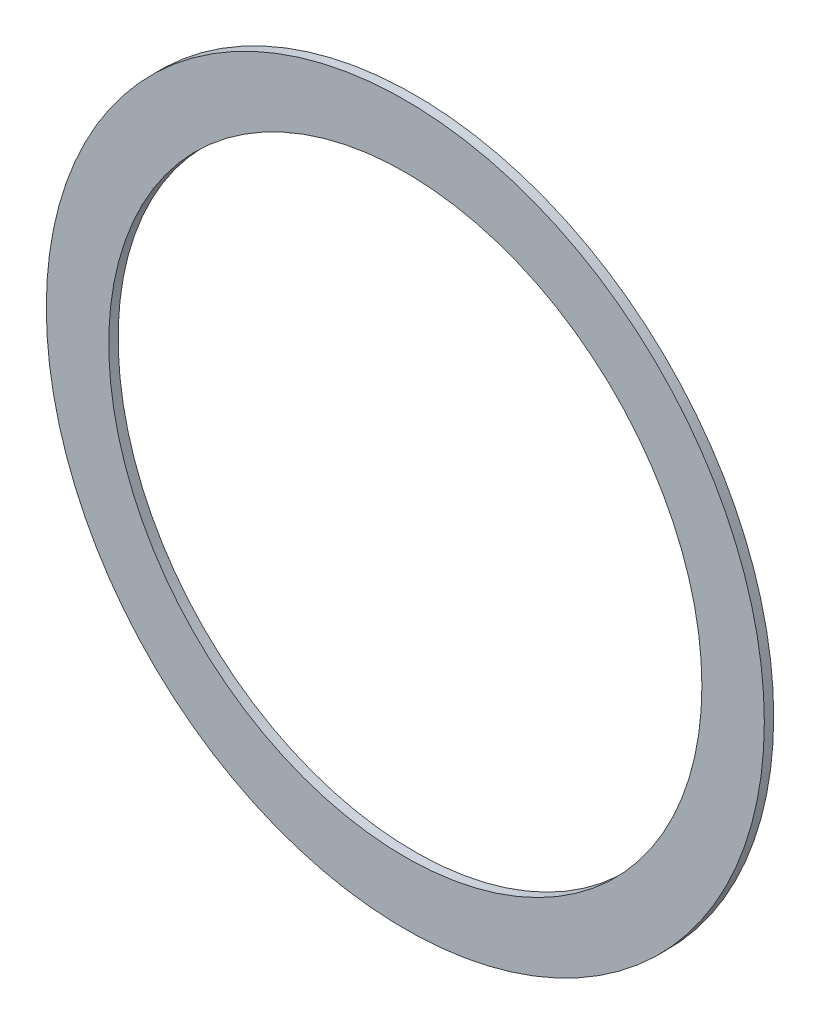
ISO-10303-21;
HEADER;
FILE_DESCRIPTION(('STEP AP214'),'2;1');
FILE_NAME('part.step','',(''),(''),'','','');
FILE_SCHEMA(('AUTOMOTIVE_DESIGN { 1 0 10303 214 1 1 1 1 }'));
ENDSEC;
DATA;
#1=APPLICATION_CONTEXT('core data for automotive mechanical design processes');
#2=APPLICATION_PROTOCOL_DEFINITION('international standard','automotive_design',2000,#1);
#3=PRODUCT_CONTEXT('',#1,'mechanical');
#4=PRODUCT('Part','Part','',(#3));
#5=PRODUCT_RELATED_PRODUCT_CATEGORY('part','',(#4));
#6=PRODUCT_DEFINITION_FORMATION('','',#4);
#7=PRODUCT_DEFINITION_CONTEXT('part definition',#1,'design');
#8=PRODUCT_DEFINITION('design','',#6,#7);
#9=PRODUCT_DEFINITION_SHAPE('','',#8);
#10=(LENGTH_UNIT() NAMED_UNIT(*) SI_UNIT(.MILLI.,.METRE.));
#11=(NAMED_UNIT(*) PLANE_ANGLE_UNIT() SI_UNIT($,.RADIAN.));
#12=(NAMED_UNIT(*) SI_UNIT($,.STERADIAN.) SOLID_ANGLE_UNIT());
#13=UNCERTAINTY_MEASURE_WITH_UNIT(LENGTH_MEASURE(1.E-05),#10,'distance_accuracy_value','');
#14=(GEOMETRIC_REPRESENTATION_CONTEXT(3) GLOBAL_UNCERTAINTY_ASSIGNED_CONTEXT((#13)) GLOBAL_UNIT_ASSIGNED_CONTEXT((#10,
#11,#12)) REPRESENTATION_CONTEXT('',''));
#15=CARTESIAN_POINT('',(0.,0.,0.));
#16=DIRECTION('',(0.,0.,1.));
#17=DIRECTION('',(1.,0.,0.));
#18=AXIS2_PLACEMENT_3D('',#15,#16,#17);
#19=CARTESIAN_POINT('',(0.,0.,3.));
#20=DIRECTION('',(0.,0.,1.));
#21=DIRECTION('',(1.,0.,0.));
#22=AXIS2_PLACEMENT_3D('',#19,#20,#21);
#23=PLANE('',#22);
#24=CARTESIAN_POINT('',(0.,0.,3.));
#25=DIRECTION('',(0.,0.,1.));
#26=DIRECTION('',(1.,0.,0.));
#27=AXIS2_PLACEMENT_3D('',#24,#25,#26);
#28=CIRCLE('',#27,115.);
#29=CARTESIAN_POINT('',(115.,0.,3.));
#30=VERTEX_POINT('',#29);
#31=EDGE_CURVE('E10',#30,#30,#28,.T.);
#32=ORIENTED_EDGE('',*,*,#31,.T.);
#33=EDGE_LOOP('',(#32));
#34=FACE_BOUND('',#33,.T.);
#35=CARTESIAN_POINT('',(0.,0.,3.));
#36=DIRECTION('',(0.,0.,1.));
#37=DIRECTION('',(1.,0.,0.));
#38=AXIS2_PLACEMENT_3D('',#35,#36,#37);
#39=CIRCLE('',#38,95.);
#40=CARTESIAN_POINT('',(95.,0.,3.));
#41=VERTEX_POINT('',#40);
#42=EDGE_CURVE('E42',#41,#41,#39,.T.);
#43=ORIENTED_EDGE('',*,*,#42,.F.);
#44=EDGE_LOOP('',(#43));
#45=FACE_BOUND('',#44,.T.);
#46=ADVANCED_FACE('F31',(#34,#45),#23,.T.);
#47=CARTESIAN_POINT('',(0.,0.,0.));
#48=DIRECTION('',(0.,0.,1.));
#49=DIRECTION('',(1.,0.,0.));
#50=AXIS2_PLACEMENT_3D('',#47,#48,#49);
#51=PLANE('',#50);
#52=CARTESIAN_POINT('',(0.,0.,0.));
#53=DIRECTION('',(0.,0.,1.));
#54=DIRECTION('',(1.,0.,0.));
#55=AXIS2_PLACEMENT_3D('',#52,#53,#54);
#56=CIRCLE('',#55,115.);
#57=CARTESIAN_POINT('',(115.,0.,0.));
#58=VERTEX_POINT('',#57);
#59=EDGE_CURVE('E35',#58,#58,#56,.T.);
#60=ORIENTED_EDGE('',*,*,#59,.F.);
#61=EDGE_LOOP('',(#60));
#62=FACE_BOUND('',#61,.T.);
#63=CARTESIAN_POINT('',(0.,0.,0.));
#64=DIRECTION('',(0.,0.,1.));
#65=DIRECTION('',(1.,0.,0.));
#66=AXIS2_PLACEMENT_3D('',#63,#64,#65);
#67=CIRCLE('',#66,95.);
#68=CARTESIAN_POINT('',(95.,0.,0.));
#69=VERTEX_POINT('',#68);
#70=EDGE_CURVE('E44',#69,#69,#67,.T.);
#71=ORIENTED_EDGE('',*,*,#70,.T.);
#72=EDGE_LOOP('',(#71));
#73=FACE_BOUND('',#72,.T.);
#74=ADVANCED_FACE('F54',(#62,#73),#51,.F.);
#75=CARTESIAN_POINT('',(0.,0.,3.));
#76=DIRECTION('',(0.,0.,-1.));
#77=DIRECTION('',(-1.,0.,0.));
#78=AXIS2_PLACEMENT_3D('',#75,#76,#77);
#79=CYLINDRICAL_SURFACE('',#78,115.);
#80=ORIENTED_EDGE('',*,*,#31,.F.);
#81=EDGE_LOOP('',(#80));
#82=FACE_BOUND('',#81,.T.);
#83=ORIENTED_EDGE('',*,*,#59,.T.);
#84=EDGE_LOOP('',(#83));
#85=FACE_BOUND('',#84,.T.);
#86=ADVANCED_FACE('F33',(#82,#85),#79,.T.);
#87=CARTESIAN_POINT('',(0.,0.,3.));
#88=DIRECTION('',(0.,0.,-1.));
#89=DIRECTION('',(-1.,0.,0.));
#90=AXIS2_PLACEMENT_3D('',#87,#88,#89);
#91=CYLINDRICAL_SURFACE('',#90,95.);
#92=ORIENTED_EDGE('',*,*,#42,.T.);
#93=EDGE_LOOP('',(#92));
#94=FACE_BOUND('',#93,.T.);
#95=ORIENTED_EDGE('',*,*,#70,.F.);
#96=EDGE_LOOP('',(#95));
#97=FACE_BOUND('',#96,.T.);
#98=ADVANCED_FACE('F50',(#94,#97),#91,.F.);
#99=CLOSED_SHELL('',(#46,#74,#86,#98));
#100=MANIFOLD_SOLID_BREP('B2',#99);
#101=ADVANCED_BREP_SHAPE_REPRESENTATION('',(#18,#100),#14);
#102=SHAPE_DEFINITION_REPRESENTATION(#9,#101);
ENDSEC;
END-ISO-10303-21;
